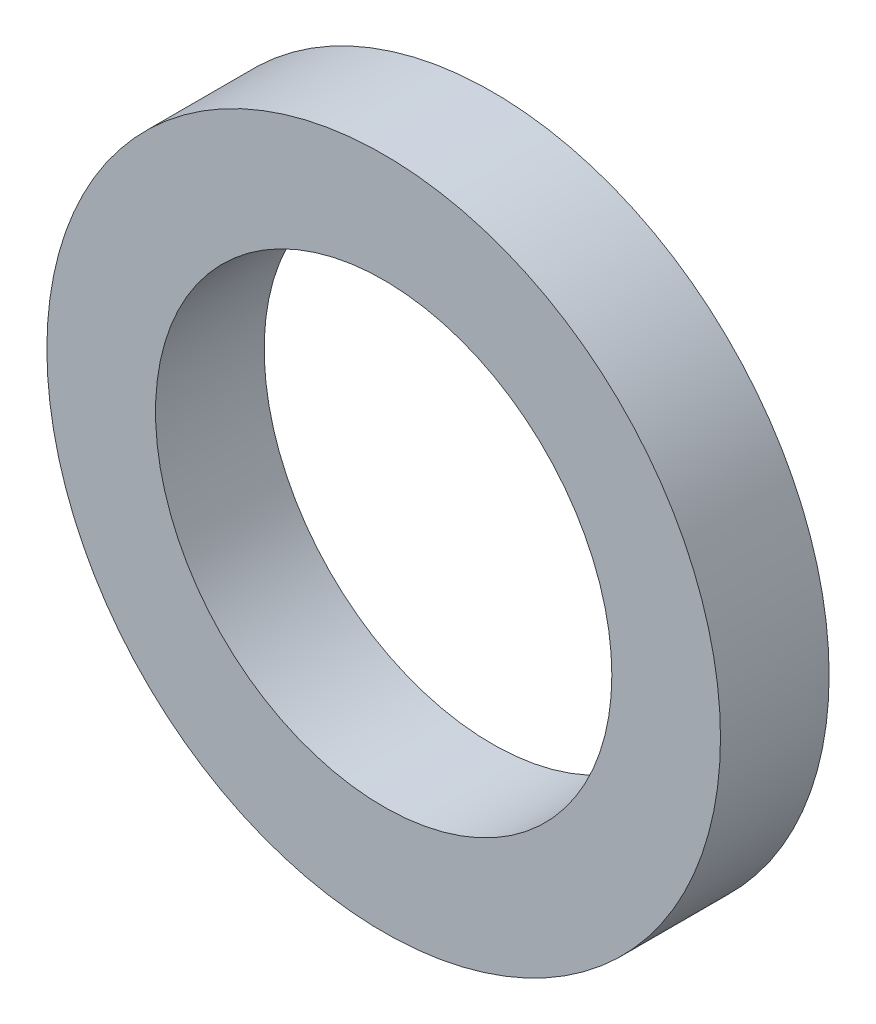
ISO-10303-21;
HEADER;
FILE_DESCRIPTION(('STEP AP214'),'2;1');
FILE_NAME('part.step','',(''),(''),'','','');
FILE_SCHEMA(('AUTOMOTIVE_DESIGN { 1 0 10303 214 1 1 1 1 }'));
ENDSEC;
DATA;
#1=APPLICATION_CONTEXT('core data for automotive mechanical design processes');
#2=APPLICATION_PROTOCOL_DEFINITION('international standard','automotive_design',2000,#1);
#3=PRODUCT_CONTEXT('',#1,'mechanical');
#4=PRODUCT('Part','Part','',(#3));
#5=PRODUCT_RELATED_PRODUCT_CATEGORY('part','',(#4));
#6=PRODUCT_DEFINITION_FORMATION('','',#4);
#7=PRODUCT_DEFINITION_CONTEXT('part definition',#1,'design');
#8=PRODUCT_DEFINITION('design','',#6,#7);
#9=PRODUCT_DEFINITION_SHAPE('','',#8);
#10=(LENGTH_UNIT() NAMED_UNIT(*) SI_UNIT(.MILLI.,.METRE.));
#11=(NAMED_UNIT(*) PLANE_ANGLE_UNIT() SI_UNIT($,.RADIAN.));
#12=(NAMED_UNIT(*) SI_UNIT($,.STERADIAN.) SOLID_ANGLE_UNIT());
#13=UNCERTAINTY_MEASURE_WITH_UNIT(LENGTH_MEASURE(1.E-05),#10,'distance_accuracy_value','');
#14=(GEOMETRIC_REPRESENTATION_CONTEXT(3) GLOBAL_UNCERTAINTY_ASSIGNED_CONTEXT((#13)) GLOBAL_UNIT_ASSIGNED_CONTEXT((#10,
#11,#12)) REPRESENTATION_CONTEXT('',''));
#15=CARTESIAN_POINT('',(0.,0.,0.));
#16=DIRECTION('',(0.,0.,1.));
#17=DIRECTION('',(1.,0.,0.));
#18=AXIS2_PLACEMENT_3D('',#15,#16,#17);
#19=CARTESIAN_POINT('',(0.,0.,1.));
#20=DIRECTION('',(0.,0.,1.));
#21=DIRECTION('',(1.,0.,0.));
#22=AXIS2_PLACEMENT_3D('',#19,#20,#21);
#23=PLANE('',#22);
#24=CARTESIAN_POINT('',(0.,0.,1.));
#25=DIRECTION('',(0.,0.,1.));
#26=DIRECTION('',(1.,0.,0.));
#27=AXIS2_PLACEMENT_3D('',#24,#25,#26);
#28=CIRCLE('',#27,3.1);
#29=CARTESIAN_POINT('',(3.1,0.,1.));
#30=VERTEX_POINT('',#29);
#31=EDGE_CURVE('E10',#30,#30,#28,.T.);
#32=ORIENTED_EDGE('',*,*,#31,.T.);
#33=EDGE_LOOP('',(#32));
#34=FACE_BOUND('',#33,.T.);
#35=CARTESIAN_POINT('',(0.,0.,1.));
#36=DIRECTION('',(0.,0.,1.));
#37=DIRECTION('',(1.,0.,0.));
#38=AXIS2_PLACEMENT_3D('',#35,#36,#37);
#39=CIRCLE('',#38,2.1);
#40=CARTESIAN_POINT('',(2.1,0.,1.));
#41=VERTEX_POINT('',#40);
#42=EDGE_CURVE('E50',#41,#41,#39,.T.);
#43=ORIENTED_EDGE('',*,*,#42,.F.);
#44=EDGE_LOOP('',(#43));
#45=FACE_BOUND('',#44,.T.);
#46=ADVANCED_FACE('F37',(#34,#45),#23,.T.);
#47=CARTESIAN_POINT('',(0.,0.,0.));
#48=DIRECTION('',(0.,0.,1.));
#49=DIRECTION('',(1.,0.,0.));
#50=AXIS2_PLACEMENT_3D('',#47,#48,#49);
#51=PLANE('',#50);
#52=CARTESIAN_POINT('',(0.,0.,0.));
#53=DIRECTION('',(0.,0.,1.));
#54=DIRECTION('',(1.,0.,0.));
#55=AXIS2_PLACEMENT_3D('',#52,#53,#54);
#56=CIRCLE('',#55,3.1);
#57=CARTESIAN_POINT('',(3.1,0.,0.));
#58=VERTEX_POINT('',#57);
#59=EDGE_CURVE('E41',#58,#58,#56,.T.);
#60=ORIENTED_EDGE('',*,*,#59,.F.);
#61=EDGE_LOOP('',(#60));
#62=FACE_BOUND('',#61,.T.);
#63=CARTESIAN_POINT('',(0.,0.,0.));
#64=DIRECTION('',(0.,0.,1.));
#65=DIRECTION('',(1.,0.,0.));
#66=AXIS2_PLACEMENT_3D('',#63,#64,#65);
#67=CIRCLE('',#66,2.1);
#68=CARTESIAN_POINT('',(2.1,0.,0.));
#69=VERTEX_POINT('',#68);
#70=EDGE_CURVE('E52',#69,#69,#67,.T.);
#71=ORIENTED_EDGE('',*,*,#70,.T.);
#72=EDGE_LOOP('',(#71));
#73=FACE_BOUND('',#72,.T.);
#74=ADVANCED_FACE('F64',(#62,#73),#51,.F.);
#75=CARTESIAN_POINT('',(0.,0.,1.));
#76=DIRECTION('',(0.,0.,-1.));
#77=DIRECTION('',(-1.,0.,0.));
#78=AXIS2_PLACEMENT_3D('',#75,#76,#77);
#79=CYLINDRICAL_SURFACE('',#78,3.1);
#80=ORIENTED_EDGE('',*,*,#31,.F.);
#81=EDGE_LOOP('',(#80));
#82=FACE_BOUND('',#81,.T.);
#83=ORIENTED_EDGE('',*,*,#59,.T.);
#84=EDGE_LOOP('',(#83));
#85=FACE_BOUND('',#84,.T.);
#86=ADVANCED_FACE('F39',(#82,#85),#79,.T.);
#87=CARTESIAN_POINT('',(0.,0.,1.));
#88=DIRECTION('',(0.,0.,-1.));
#89=DIRECTION('',(-1.,0.,0.));
#90=AXIS2_PLACEMENT_3D('',#87,#88,#89);
#91=CYLINDRICAL_SURFACE('',#90,2.1);
#92=ORIENTED_EDGE('',*,*,#42,.T.);
#93=EDGE_LOOP('',(#92));
#94=FACE_BOUND('',#93,.T.);
#95=ORIENTED_EDGE('',*,*,#70,.F.);
#96=EDGE_LOOP('',(#95));
#97=FACE_BOUND('',#96,.T.);
#98=ADVANCED_FACE('F60',(#94,#97),#91,.F.);
#99=CLOSED_SHELL('',(#46,#74,#86,#98));
#100=MANIFOLD_SOLID_BREP('B2',#99);
#101=ADVANCED_BREP_SHAPE_REPRESENTATION('',(#18,#100),#14);
#102=SHAPE_DEFINITION_REPRESENTATION(#9,#101);
ENDSEC;
END-ISO-10303-21;
